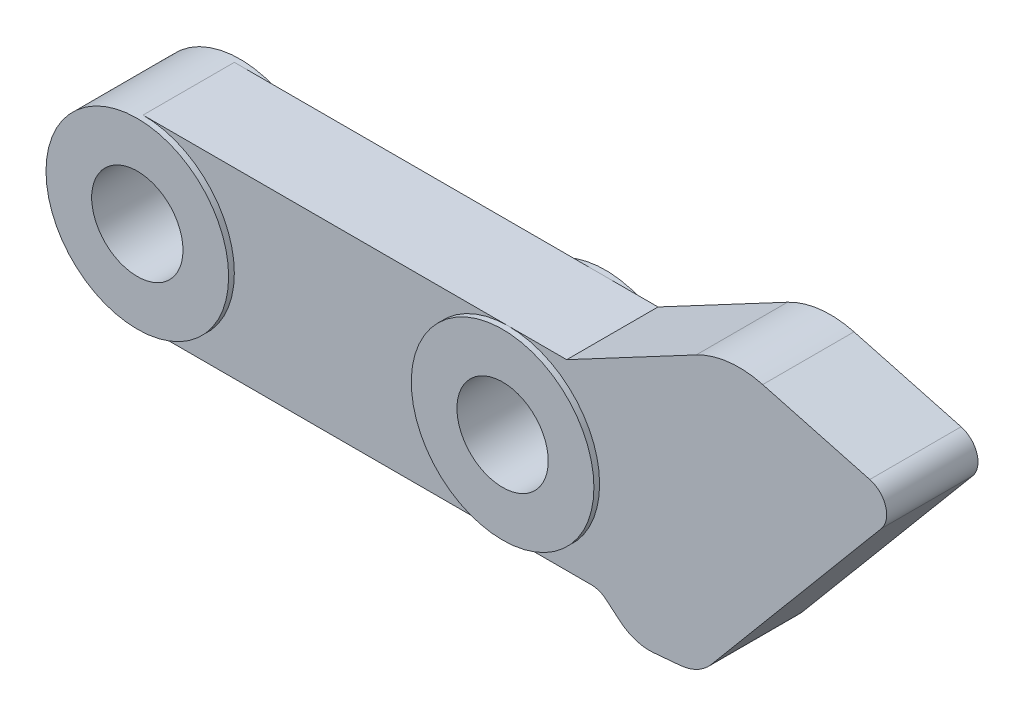
ISO-10303-21;
HEADER;
FILE_DESCRIPTION(('STEP AP214'),'2;1');
FILE_NAME('part.step','',(''),(''),'','','');
FILE_SCHEMA(('AUTOMOTIVE_DESIGN { 1 0 10303 214 1 1 1 1 }'));
ENDSEC;
DATA;
#1=APPLICATION_CONTEXT('core data for automotive mechanical design processes');
#2=APPLICATION_PROTOCOL_DEFINITION('international standard','automotive_design',2000,#1);
#3=PRODUCT_CONTEXT('',#1,'mechanical');
#4=PRODUCT('Part','Part','',(#3));
#5=PRODUCT_RELATED_PRODUCT_CATEGORY('part','',(#4));
#6=PRODUCT_DEFINITION_FORMATION('','',#4);
#7=PRODUCT_DEFINITION_CONTEXT('part definition',#1,'design');
#8=PRODUCT_DEFINITION('design','',#6,#7);
#9=PRODUCT_DEFINITION_SHAPE('','',#8);
#10=(LENGTH_UNIT() NAMED_UNIT(*) SI_UNIT(.MILLI.,.METRE.));
#11=(NAMED_UNIT(*) PLANE_ANGLE_UNIT() SI_UNIT($,.RADIAN.));
#12=(NAMED_UNIT(*) SI_UNIT($,.STERADIAN.) SOLID_ANGLE_UNIT());
#13=UNCERTAINTY_MEASURE_WITH_UNIT(LENGTH_MEASURE(1.E-05),#10,'distance_accuracy_value','');
#14=(GEOMETRIC_REPRESENTATION_CONTEXT(3) GLOBAL_UNCERTAINTY_ASSIGNED_CONTEXT((#13)) GLOBAL_UNIT_ASSIGNED_CONTEXT((#10,
#11,#12)) REPRESENTATION_CONTEXT('',''));
#15=CARTESIAN_POINT('',(0.,0.,0.));
#16=DIRECTION('',(0.,0.,1.));
#17=DIRECTION('',(1.,0.,0.));
#18=AXIS2_PLACEMENT_3D('',#15,#16,#17);
#19=CARTESIAN_POINT('',(0.,0.,0.));
#20=DIRECTION('',(0.,0.,1.));
#21=DIRECTION('',(1.,0.,0.));
#22=AXIS2_PLACEMENT_3D('',#19,#20,#21);
#23=PLANE('',#22);
#24=CARTESIAN_POINT('',(6.35,6.35,0.));
#25=DIRECTION('',(0.,0.,-1.));
#26=DIRECTION('',(-1.,0.,0.));
#27=AXIS2_PLACEMENT_3D('',#24,#25,#26);
#28=CIRCLE('',#27,6.35);
#29=CARTESIAN_POINT('',(6.35,12.7,0.));
#30=VERTEX_POINT('',#29);
#31=CARTESIAN_POINT('',(6.35,0.,0.));
#32=VERTEX_POINT('',#31);
#33=EDGE_CURVE('E153',#30,#32,#28,.T.);
#34=ORIENTED_EDGE('',*,*,#33,.F.);
#35=DIRECTION('',(-1.,0.,0.));
#36=VECTOR('',#35,1.);
#37=CARTESIAN_POINT('',(35.810782513767,12.7,0.));
#38=LINE('',#37,#36);
#39=CARTESIAN_POINT('',(31.75,12.7,0.));
#40=VERTEX_POINT('',#39);
#41=EDGE_CURVE('E162',#40,#30,#38,.T.);
#42=ORIENTED_EDGE('',*,*,#41,.F.);
#43=CARTESIAN_POINT('',(31.75,6.35,0.));
#44=DIRECTION('',(0.,0.,-1.));
#45=DIRECTION('',(-1.,0.,0.));
#46=AXIS2_PLACEMENT_3D('',#43,#44,#45);
#47=CIRCLE('',#46,6.35);
#48=CARTESIAN_POINT('',(31.75,0.,0.));
#49=VERTEX_POINT('',#48);
#50=EDGE_CURVE('E192',#49,#40,#47,.T.);
#51=ORIENTED_EDGE('',*,*,#50,.F.);
#52=DIRECTION('',(1.,0.,0.));
#53=VECTOR('',#52,1.);
#54=CARTESIAN_POINT('',(0.,0.,0.));
#55=LINE('',#54,#53);
#56=EDGE_CURVE('E173',#32,#49,#55,.T.);
#57=ORIENTED_EDGE('',*,*,#56,.F.);
#58=EDGE_LOOP('',(#34,#42,#51,#57));
#59=FACE_BOUND('',#58,.T.);
#60=ADVANCED_FACE('F32',(#59),#23,.F.);
#61=DIRECTION('',(0.996194698091746,0.0871557427476539,0.));
#62=VECTOR('',#61,1.);
#63=CARTESIAN_POINT('',(45.0052328745603,-1.64951021460678,0.));
#64=LINE('',#63,#62);
#65=CARTESIAN_POINT('',(43.695109273344,-1.76413117753096,0.));
#66=VERTEX_POINT('',#65);
#67=CARTESIAN_POINT('',(41.842314708119,-1.92622969783059,0.));
#68=VERTEX_POINT('',#67);
#69=EDGE_CURVE('E270',#66,#68,#64,.F.);
#70=ORIENTED_EDGE('',*,*,#69,.T.);
#71=CARTESIAN_POINT('',(41.5655952248952,1.23668846861071,0.));
#72=DIRECTION('',(0.,0.,1.));
#73=DIRECTION('',(1.,0.,0.));
#74=AXIS2_PLACEMENT_3D('',#71,#72,#73);
#75=CIRCLE('',#74,3.175);
#76=CARTESIAN_POINT('',(39.5247445641404,-1.19550263829205,0.));
#77=VERTEX_POINT('',#76);
#78=EDGE_CURVE('E40',#68,#77,#75,.F.);
#79=ORIENTED_EDGE('',*,*,#78,.T.);
#80=DIRECTION('',(0.766044443118977,-0.64278760968654,0.));
#81=VECTOR('',#80,1.);
#82=CARTESIAN_POINT('',(38.1,0.,0.));
#83=LINE('',#82,#81);
#84=CARTESIAN_POINT('',(38.5426225834798,-0.371404446548626,0.));
#85=VERTEX_POINT('',#84);
#86=EDGE_CURVE('E227',#85,#77,#83,.T.);
#87=ORIENTED_EDGE('',*,*,#86,.F.);
#88=CARTESIAN_POINT('',(37.5221972531024,-1.5875,0.));
#89=DIRECTION('',(0.,0.,1.));
#90=DIRECTION('',(1.,0.,0.));
#91=AXIS2_PLACEMENT_3D('',#88,#89,#90);
#92=CIRCLE('',#91,1.5875);
#93=CARTESIAN_POINT('',(37.5221972531024,0.,0.));
#94=VERTEX_POINT('',#93);
#95=EDGE_CURVE('E266',#85,#94,#92,.T.);
#96=ORIENTED_EDGE('',*,*,#95,.T.);
#97=EDGE_CURVE('E228',#49,#94,#55,.T.);
#98=ORIENTED_EDGE('',*,*,#97,.F.);
#99=EDGE_CURVE('E185',#40,#49,#47,.T.);
#100=ORIENTED_EDGE('',*,*,#99,.F.);
#101=CARTESIAN_POINT('',(35.810782513767,12.7,0.));
#102=VERTEX_POINT('',#101);
#103=EDGE_CURVE('E166',#102,#40,#38,.T.);
#104=ORIENTED_EDGE('',*,*,#103,.F.);
#105=DIRECTION('',(-0.882924960016178,-0.469514126497201,0.));
#106=VECTOR('',#105,1.);
#107=CARTESIAN_POINT('',(47.0239295059724,18.6628294065145,0.));
#108=LINE('',#107,#106);
#109=CARTESIAN_POINT('',(44.8152853652607,17.4883359088446,0.));
#110=VERTEX_POINT('',#109);
#111=EDGE_CURVE('E169',#110,#102,#108,.T.);
#112=ORIENTED_EDGE('',*,*,#111,.F.);
#113=CARTESIAN_POINT('',(47.7967000685179,11.8817624127418,0.));
#114=DIRECTION('',(0.,0.,1.));
#115=DIRECTION('',(1.,0.,0.));
#116=AXIS2_PLACEMENT_3D('',#113,#114,#115);
#117=CIRCLE('',#116,6.35);
#118=CARTESIAN_POINT('',(49.4402010049189,18.0153914096774,0.));
#119=VERTEX_POINT('',#118);
#120=EDGE_CURVE('E240',#110,#119,#117,.F.);
#121=ORIENTED_EDGE('',*,*,#120,.T.);
#122=DIRECTION('',(-0.965925826289069,0.258819045102517,0.));
#123=VECTOR('',#122,1.);
#124=CARTESIAN_POINT('',(59.2911874998436,15.3758275337125,0.));
#125=LINE('',#124,#123);
#126=CARTESIAN_POINT('',(56.8842202568738,16.0207724626744,0.));
#127=VERTEX_POINT('',#126);
#128=EDGE_CURVE('E233',#127,#119,#125,.T.);
#129=ORIENTED_EDGE('',*,*,#128,.F.);
#130=CARTESIAN_POINT('',(56.4733450227735,14.4873652134405,0.));
#131=DIRECTION('',(0.,0.,1.));
#132=DIRECTION('',(1.,0.,0.));
#133=AXIS2_PLACEMENT_3D('',#130,#131,#132);
#134=CIRCLE('',#133,1.5875);
#135=CARTESIAN_POINT('',(57.6894405762249,13.4669398830632,0.));
#136=VERTEX_POINT('',#135);
#137=EDGE_CURVE('E253',#127,#136,#134,.F.);
#138=ORIENTED_EDGE('',*,*,#137,.T.);
#139=DIRECTION('',(0.64278760968654,0.766044443118977,0.));
#140=VECTOR('',#139,1.);
#141=CARTESIAN_POINT('',(42.9643822138055,-4.08170132150953,0.));
#142=LINE('',#141,#140);
#143=CARTESIAN_POINT('',(45.850580897023,-0.642063671844426,0.));
#144=VERTEX_POINT('',#143);
#145=EDGE_CURVE('E231',#144,#136,#142,.T.);
#146=ORIENTED_EDGE('',*,*,#145,.F.);
#147=CARTESIAN_POINT('',(43.4183897901202,1.39878698891034,0.));
#148=DIRECTION('',(0.,0.,1.));
#149=DIRECTION('',(1.,0.,0.));
#150=AXIS2_PLACEMENT_3D('',#147,#148,#149);
#151=CIRCLE('',#150,3.175);
#152=EDGE_CURVE('E47',#144,#66,#151,.F.);
#153=ORIENTED_EDGE('',*,*,#152,.T.);
#154=EDGE_LOOP('',(#70,#79,#87,#96,#98,#100,#104,#112,#121,#129,#138,#146,#153));
#155=FACE_BOUND('',#154,.T.);
#156=ADVANCED_FACE('F288',(#155),#23,.F.);
#157=CARTESIAN_POINT('',(0.,0.,6.35));
#158=DIRECTION('',(0.,0.,1.));
#159=DIRECTION('',(1.,0.,0.));
#160=AXIS2_PLACEMENT_3D('',#157,#158,#159);
#161=PLANE('',#160);
#162=DIRECTION('',(-1.,0.,0.));
#163=VECTOR('',#162,1.);
#164=CARTESIAN_POINT('',(35.810782513767,12.7,6.35));
#165=LINE('',#164,#163);
#166=CARTESIAN_POINT('',(31.75,12.7,6.35));
#167=VERTEX_POINT('',#166);
#168=CARTESIAN_POINT('',(6.35,12.7,6.35));
#169=VERTEX_POINT('',#168);
#170=EDGE_CURVE('E222',#167,#169,#165,.T.);
#171=ORIENTED_EDGE('',*,*,#170,.T.);
#172=CARTESIAN_POINT('',(6.35,6.35,6.35));
#173=DIRECTION('',(0.,0.,1.));
#174=DIRECTION('',(1.,0.,0.));
#175=AXIS2_PLACEMENT_3D('',#172,#173,#174);
#176=CIRCLE('',#175,6.35);
#177=CARTESIAN_POINT('',(6.35,0.,6.35));
#178=VERTEX_POINT('',#177);
#179=EDGE_CURVE('E155',#178,#169,#176,.T.);
#180=ORIENTED_EDGE('',*,*,#179,.F.);
#181=DIRECTION('',(1.,0.,0.));
#182=VECTOR('',#181,1.);
#183=CARTESIAN_POINT('',(0.,0.,6.35));
#184=LINE('',#183,#182);
#185=CARTESIAN_POINT('',(31.75,0.,6.35));
#186=VERTEX_POINT('',#185);
#187=EDGE_CURVE('E209',#178,#186,#184,.T.);
#188=ORIENTED_EDGE('',*,*,#187,.T.);
#189=CARTESIAN_POINT('',(31.75,6.35,6.35));
#190=DIRECTION('',(0.,0.,1.));
#191=DIRECTION('',(1.,0.,0.));
#192=AXIS2_PLACEMENT_3D('',#189,#190,#191);
#193=CIRCLE('',#192,6.35);
#194=EDGE_CURVE('E202',#167,#186,#193,.T.);
#195=ORIENTED_EDGE('',*,*,#194,.F.);
#196=EDGE_LOOP('',(#171,#180,#188,#195));
#197=FACE_BOUND('',#196,.T.);
#198=ADVANCED_FACE('F336',(#197),#161,.T.);
#199=CARTESIAN_POINT('',(0.,0.,6.35));
#200=DIRECTION('',(0.,1.,0.));
#201=DIRECTION('',(0.,0.,1.));
#202=AXIS2_PLACEMENT_3D('',#199,#200,#201);
#203=PLANE('',#202);
#204=ORIENTED_EDGE('',*,*,#97,.T.);
#205=DIRECTION('',(0.,0.,-1.));
#206=VECTOR('',#205,1.);
#207=CARTESIAN_POINT('',(37.5221972531024,0.,6.35));
#208=LINE('',#207,#206);
#209=CARTESIAN_POINT('',(37.5221972531024,0.,6.35));
#210=VERTEX_POINT('',#209);
#211=EDGE_CURVE('E264',#94,#210,#208,.F.);
#212=ORIENTED_EDGE('',*,*,#211,.T.);
#213=EDGE_CURVE('E213',#186,#210,#184,.T.);
#214=ORIENTED_EDGE('',*,*,#213,.F.);
#215=ORIENTED_EDGE('',*,*,#187,.F.);
#216=DIRECTION('',(0.,0.,-1.));
#217=VECTOR('',#216,1.);
#218=CARTESIAN_POINT('',(6.35,0.,6.35));
#219=LINE('',#218,#217);
#220=EDGE_CURVE('E159',#178,#32,#219,.T.);
#221=ORIENTED_EDGE('',*,*,#220,.T.);
#222=ORIENTED_EDGE('',*,*,#56,.T.);
#223=EDGE_LOOP('',(#204,#212,#214,#215,#221,#222));
#224=FACE_BOUND('',#223,.T.);
#225=ADVANCED_FACE('F333',(#224),#203,.F.);
#226=CARTESIAN_POINT('',(38.1,0.,6.35));
#227=DIRECTION('',(0.64278760968654,0.766044443118977,0.));
#228=DIRECTION('',(-0.766044443118977,0.64278760968654,0.));
#229=AXIS2_PLACEMENT_3D('',#226,#227,#228);
#230=PLANE('',#229);
#231=ORIENTED_EDGE('',*,*,#86,.T.);
#232=DIRECTION('',(0.,0.,-1.));
#233=VECTOR('',#232,1.);
#234=CARTESIAN_POINT('',(39.5247445641404,-1.19550263829205,6.35));
#235=LINE('',#234,#233);
#236=CARTESIAN_POINT('',(39.5247445641404,-1.19550263829205,6.35));
#237=VERTEX_POINT('',#236);
#238=EDGE_CURVE('E275',#77,#237,#235,.F.);
#239=ORIENTED_EDGE('',*,*,#238,.T.);
#240=DIRECTION('',(0.766044443118977,-0.64278760968654,0.));
#241=VECTOR('',#240,1.);
#242=CARTESIAN_POINT('',(38.1,0.,6.35));
#243=LINE('',#242,#241);
#244=CARTESIAN_POINT('',(38.5426225834798,-0.371404446548626,6.35));
#245=VERTEX_POINT('',#244);
#246=EDGE_CURVE('E212',#245,#237,#243,.T.);
#247=ORIENTED_EDGE('',*,*,#246,.F.);
#248=DIRECTION('',(0.,0.,-1.));
#249=VECTOR('',#248,1.);
#250=CARTESIAN_POINT('',(38.5426225834798,-0.371404446548626,0.));
#251=LINE('',#250,#249);
#252=EDGE_CURVE('E261',#245,#85,#251,.T.);
#253=ORIENTED_EDGE('',*,*,#252,.T.);
#254=EDGE_LOOP('',(#231,#239,#247,#253));
#255=FACE_BOUND('',#254,.T.);
#256=ADVANCED_FACE('F292',(#255),#230,.F.);
#257=CARTESIAN_POINT('',(42.9643822138055,-4.08170132150953,6.35));
#258=DIRECTION('',(-0.766044443118977,0.64278760968654,0.));
#259=DIRECTION('',(-0.64278760968654,-0.766044443118978,0.));
#260=AXIS2_PLACEMENT_3D('',#257,#258,#259);
#261=PLANE('',#260);
#262=DIRECTION('',(0.64278760968654,0.766044443118977,0.));
#263=VECTOR('',#262,1.);
#264=CARTESIAN_POINT('',(42.9643822138055,-4.08170132150953,6.35));
#265=LINE('',#264,#263);
#266=CARTESIAN_POINT('',(45.850580897023,-0.642063671844426,6.35));
#267=VERTEX_POINT('',#266);
#268=CARTESIAN_POINT('',(57.6894405762249,13.4669398830632,6.35));
#269=VERTEX_POINT('',#268);
#270=EDGE_CURVE('E216',#267,#269,#265,.T.);
#271=ORIENTED_EDGE('',*,*,#270,.F.);
#272=DIRECTION('',(0.,0.,1.));
#273=VECTOR('',#272,1.);
#274=CARTESIAN_POINT('',(45.850580897023,-0.642063671844426,0.));
#275=LINE('',#274,#273);
#276=EDGE_CURVE('E11',#267,#144,#275,.F.);
#277=ORIENTED_EDGE('',*,*,#276,.T.);
#278=ORIENTED_EDGE('',*,*,#145,.T.);
#279=DIRECTION('',(0.,0.,-1.));
#280=VECTOR('',#279,1.);
#281=CARTESIAN_POINT('',(57.6894405762249,13.4669398830632,6.35));
#282=LINE('',#281,#280);
#283=EDGE_CURVE('E256',#136,#269,#282,.F.);
#284=ORIENTED_EDGE('',*,*,#283,.T.);
#285=EDGE_LOOP('',(#271,#277,#278,#284));
#286=FACE_BOUND('',#285,.T.);
#287=ADVANCED_FACE('F302',(#286),#261,.F.);
#288=CARTESIAN_POINT('',(59.2911874998436,15.3758275337125,6.35));
#289=DIRECTION('',(-0.258819045102517,-0.965925826289069,0.));
#290=DIRECTION('',(0.96592582628907,-0.258819045102517,0.));
#291=AXIS2_PLACEMENT_3D('',#288,#289,#290);
#292=PLANE('',#291);
#293=DIRECTION('',(-0.965925826289069,0.258819045102517,0.));
#294=VECTOR('',#293,1.);
#295=CARTESIAN_POINT('',(59.2911874998436,15.3758275337125,6.35));
#296=LINE('',#295,#294);
#297=CARTESIAN_POINT('',(56.8842202568738,16.0207724626744,6.35));
#298=VERTEX_POINT('',#297);
#299=CARTESIAN_POINT('',(49.4402010049189,18.0153914096774,6.35));
#300=VERTEX_POINT('',#299);
#301=EDGE_CURVE('E218',#298,#300,#296,.T.);
#302=ORIENTED_EDGE('',*,*,#301,.F.);
#303=DIRECTION('',(0.,0.,-1.));
#304=VECTOR('',#303,1.);
#305=CARTESIAN_POINT('',(56.8842202568738,16.0207724626744,6.35));
#306=LINE('',#305,#304);
#307=EDGE_CURVE('E250',#298,#127,#306,.T.);
#308=ORIENTED_EDGE('',*,*,#307,.T.);
#309=ORIENTED_EDGE('',*,*,#128,.T.);
#310=DIRECTION('',(0.,0.,-1.));
#311=VECTOR('',#310,1.);
#312=CARTESIAN_POINT('',(49.4402010049189,18.0153914096774,6.35));
#313=LINE('',#312,#311);
#314=EDGE_CURVE('E243',#119,#300,#313,.F.);
#315=ORIENTED_EDGE('',*,*,#314,.T.);
#316=EDGE_LOOP('',(#302,#308,#309,#315));
#317=FACE_BOUND('',#316,.T.);
#318=ADVANCED_FACE('F311',(#317),#292,.F.);
#319=CARTESIAN_POINT('',(47.0239295059724,18.6628294065145,6.35));
#320=DIRECTION('',(0.469514126497201,-0.882924960016178,0.));
#321=DIRECTION('',(0.882924960016178,0.469514126497201,0.));
#322=AXIS2_PLACEMENT_3D('',#319,#320,#321);
#323=PLANE('',#322);
#324=DIRECTION('',(-0.882924960016178,-0.469514126497201,0.));
#325=VECTOR('',#324,1.);
#326=CARTESIAN_POINT('',(47.0239295059724,18.6628294065145,6.35));
#327=LINE('',#326,#325);
#328=CARTESIAN_POINT('',(44.8152853652607,17.4883359088446,6.35));
#329=VERTEX_POINT('',#328);
#330=CARTESIAN_POINT('',(35.810782513767,12.7,6.35));
#331=VERTEX_POINT('',#330);
#332=EDGE_CURVE('E220',#329,#331,#327,.T.);
#333=ORIENTED_EDGE('',*,*,#332,.F.);
#334=DIRECTION('',(0.,0.,-1.));
#335=VECTOR('',#334,1.);
#336=CARTESIAN_POINT('',(44.8152853652607,17.4883359088446,6.35));
#337=LINE('',#336,#335);
#338=EDGE_CURVE('E237',#329,#110,#337,.T.);
#339=ORIENTED_EDGE('',*,*,#338,.T.);
#340=ORIENTED_EDGE('',*,*,#111,.T.);
#341=DIRECTION('',(0.,0.,-1.));
#342=VECTOR('',#341,1.);
#343=CARTESIAN_POINT('',(35.810782513767,12.7,6.35));
#344=LINE('',#343,#342);
#345=EDGE_CURVE('E225',#331,#102,#344,.T.);
#346=ORIENTED_EDGE('',*,*,#345,.F.);
#347=EDGE_LOOP('',(#333,#339,#340,#346));
#348=FACE_BOUND('',#347,.T.);
#349=ADVANCED_FACE('F321',(#348),#323,.F.);
#350=CARTESIAN_POINT('',(35.810782513767,12.7,6.35));
#351=DIRECTION('',(0.,-1.,0.));
#352=DIRECTION('',(1.,0.,0.));
#353=AXIS2_PLACEMENT_3D('',#350,#351,#352);
#354=PLANE('',#353);
#355=ORIENTED_EDGE('',*,*,#103,.T.);
#356=ORIENTED_EDGE('',*,*,#41,.T.);
#357=DIRECTION('',(0.,0.,-1.));
#358=VECTOR('',#357,1.);
#359=CARTESIAN_POINT('',(6.35,12.7,6.35));
#360=LINE('',#359,#358);
#361=EDGE_CURVE('E148',#30,#169,#360,.F.);
#362=ORIENTED_EDGE('',*,*,#361,.T.);
#363=ORIENTED_EDGE('',*,*,#170,.F.);
#364=EDGE_CURVE('E223',#331,#167,#165,.T.);
#365=ORIENTED_EDGE('',*,*,#364,.F.);
#366=ORIENTED_EDGE('',*,*,#345,.T.);
#367=EDGE_LOOP('',(#355,#356,#362,#363,#365,#366));
#368=FACE_BOUND('',#367,.T.);
#369=ADVANCED_FACE('F163',(#368),#354,.F.);
#370=ORIENTED_EDGE('',*,*,#246,.T.);
#371=CARTESIAN_POINT('',(41.5655952248952,1.23668846861071,6.35));
#372=DIRECTION('',(0.,0.,1.));
#373=DIRECTION('',(1.,0.,0.));
#374=AXIS2_PLACEMENT_3D('',#371,#372,#373);
#375=CIRCLE('',#374,3.175);
#376=CARTESIAN_POINT('',(41.842314708119,-1.92622969783058,6.35));
#377=VERTEX_POINT('',#376);
#378=EDGE_CURVE('E280',#237,#377,#375,.T.);
#379=ORIENTED_EDGE('',*,*,#378,.T.);
#380=DIRECTION('',(-0.996194698091746,-0.0871557427476539,0.));
#381=VECTOR('',#380,1.);
#382=CARTESIAN_POINT('',(0.485082528191393,-5.54451866838361,6.35));
#383=LINE('',#382,#381);
#384=CARTESIAN_POINT('',(43.6951092733441,-1.76413117753096,6.35));
#385=VERTEX_POINT('',#384);
#386=EDGE_CURVE('E272',#377,#385,#383,.F.);
#387=ORIENTED_EDGE('',*,*,#386,.T.);
#388=CARTESIAN_POINT('',(43.4183897901202,1.39878698891034,6.35));
#389=DIRECTION('',(0.,0.,1.));
#390=DIRECTION('',(1.,0.,0.));
#391=AXIS2_PLACEMENT_3D('',#388,#389,#390);
#392=CIRCLE('',#391,3.175);
#393=EDGE_CURVE('E278',#385,#267,#392,.T.);
#394=ORIENTED_EDGE('',*,*,#393,.T.);
#395=ORIENTED_EDGE('',*,*,#270,.T.);
#396=CARTESIAN_POINT('',(56.4733450227735,14.4873652134405,6.35));
#397=DIRECTION('',(0.,0.,1.));
#398=DIRECTION('',(1.,0.,0.));
#399=AXIS2_PLACEMENT_3D('',#396,#397,#398);
#400=CIRCLE('',#399,1.5875);
#401=EDGE_CURVE('E259',#269,#298,#400,.T.);
#402=ORIENTED_EDGE('',*,*,#401,.T.);
#403=ORIENTED_EDGE('',*,*,#301,.T.);
#404=CARTESIAN_POINT('',(47.7967000685179,11.8817624127418,6.35));
#405=DIRECTION('',(0.,0.,1.));
#406=DIRECTION('',(1.,0.,0.));
#407=AXIS2_PLACEMENT_3D('',#404,#405,#406);
#408=CIRCLE('',#407,6.35);
#409=EDGE_CURVE('E246',#300,#329,#408,.T.);
#410=ORIENTED_EDGE('',*,*,#409,.T.);
#411=ORIENTED_EDGE('',*,*,#332,.T.);
#412=ORIENTED_EDGE('',*,*,#364,.T.);
#413=EDGE_CURVE('E158',#186,#167,#193,.T.);
#414=ORIENTED_EDGE('',*,*,#413,.F.);
#415=ORIENTED_EDGE('',*,*,#213,.T.);
#416=CARTESIAN_POINT('',(37.5221972531024,-1.5875,6.35));
#417=DIRECTION('',(0.,0.,1.));
#418=DIRECTION('',(1.,0.,0.));
#419=AXIS2_PLACEMENT_3D('',#416,#417,#418);
#420=CIRCLE('',#419,1.5875);
#421=EDGE_CURVE('E268',#210,#245,#420,.F.);
#422=ORIENTED_EDGE('',*,*,#421,.T.);
#423=EDGE_LOOP('',(#370,#379,#387,#394,#395,#402,#403,#410,#411,#412,#414,#415,#422));
#424=FACE_BOUND('',#423,.T.);
#425=ADVANCED_FACE('F297',(#424),#161,.T.);
#426=CARTESIAN_POINT('',(47.7967000685179,11.8817624127418,6.35));
#427=DIRECTION('',(0.,0.,-1.));
#428=DIRECTION('',(-1.,0.,0.));
#429=AXIS2_PLACEMENT_3D('',#426,#427,#428);
#430=CYLINDRICAL_SURFACE('',#429,6.35);
#431=ORIENTED_EDGE('',*,*,#409,.F.);
#432=ORIENTED_EDGE('',*,*,#314,.F.);
#433=ORIENTED_EDGE('',*,*,#120,.F.);
#434=ORIENTED_EDGE('',*,*,#338,.F.);
#435=EDGE_LOOP('',(#431,#432,#433,#434));
#436=FACE_BOUND('',#435,.T.);
#437=ADVANCED_FACE('F317',(#436),#430,.T.);
#438=CARTESIAN_POINT('',(6.35,6.35,6.35));
#439=DIRECTION('',(0.,0.,-1.));
#440=DIRECTION('',(-1.,0.,0.));
#441=AXIS2_PLACEMENT_3D('',#438,#439,#440);
#442=CYLINDRICAL_SURFACE('',#441,6.35);
#443=DIRECTION('',(0.,0.,-1.));
#444=VECTOR('',#443,1.);
#445=CARTESIAN_POINT('',(0.,6.35,6.35));
#446=LINE('',#445,#444);
#447=CARTESIAN_POINT('',(0.,6.35,6.35));
#448=VERTEX_POINT('',#447);
#449=CARTESIAN_POINT('',(0.,6.35,0.));
#450=VERTEX_POINT('',#449);
#451=EDGE_CURVE('E206',#448,#450,#446,.T.);
#452=ORIENTED_EDGE('',*,*,#451,.T.);
#453=ORIENTED_EDGE('',*,*,#451,.F.);
#454=EDGE_LOOP('',(#452,#453));
#455=FACE_BOUND('',#454,.T.);
#456=ORIENTED_EDGE('',*,*,#33,.T.);
#457=ORIENTED_EDGE('',*,*,#220,.F.);
#458=ORIENTED_EDGE('',*,*,#179,.T.);
#459=ORIENTED_EDGE('',*,*,#361,.F.);
#460=EDGE_LOOP('',(#456,#457,#458,#459));
#461=FACE_BOUND('',#460,.T.);
#462=CARTESIAN_POINT('',(6.35,6.35,6.746875));
#463=DIRECTION('',(0.,0.,1.));
#464=DIRECTION('',(1.,0.,0.));
#465=AXIS2_PLACEMENT_3D('',#462,#463,#464);
#466=CIRCLE('',#465,6.35);
#467=CARTESIAN_POINT('',(12.7,6.35,6.746875));
#468=VERTEX_POINT('',#467);
#469=EDGE_CURVE('E195',#468,#468,#466,.T.);
#470=ORIENTED_EDGE('',*,*,#469,.F.);
#471=EDGE_LOOP('',(#470));
#472=FACE_BOUND('',#471,.T.);
#473=CARTESIAN_POINT('',(6.35,6.35,-0.396875));
#474=DIRECTION('',(0.,0.,-1.));
#475=DIRECTION('',(-1.,0.,0.));
#476=AXIS2_PLACEMENT_3D('',#473,#474,#475);
#477=CIRCLE('',#476,6.35);
#478=CARTESIAN_POINT('',(0.,6.35,-0.396875));
#479=VERTEX_POINT('',#478);
#480=EDGE_CURVE('E174',#479,#479,#477,.T.);
#481=ORIENTED_EDGE('',*,*,#480,.F.);
#482=EDGE_LOOP('',(#481));
#483=FACE_BOUND('',#482,.T.);
#484=ADVANCED_FACE('F150',(#455,#461,#472,#483),#442,.T.);
#485=CARTESIAN_POINT('',(31.75,6.35,-8.98025612106915));
#486=DIRECTION('',(0.,0.,1.));
#487=DIRECTION('',(1.,0.,0.));
#488=AXIS2_PLACEMENT_3D('',#485,#486,#487);
#489=CYLINDRICAL_SURFACE('',#488,3.175);
#490=CARTESIAN_POINT('',(31.75,6.35,6.746875));
#491=DIRECTION('',(0.,0.,1.));
#492=DIRECTION('',(1.,0.,0.));
#493=AXIS2_PLACEMENT_3D('',#490,#491,#492);
#494=CIRCLE('',#493,3.175);
#495=CARTESIAN_POINT('',(34.925,6.35,6.746875));
#496=VERTEX_POINT('',#495);
#497=EDGE_CURVE('E198',#496,#496,#494,.T.);
#498=ORIENTED_EDGE('',*,*,#497,.T.);
#499=EDGE_LOOP('',(#498));
#500=FACE_BOUND('',#499,.T.);
#501=CARTESIAN_POINT('',(31.75,6.35,-0.396875));
#502=DIRECTION('',(0.,0.,-1.));
#503=DIRECTION('',(-1.,0.,0.));
#504=AXIS2_PLACEMENT_3D('',#501,#502,#503);
#505=CIRCLE('',#504,3.175);
#506=CARTESIAN_POINT('',(28.575,6.35,-0.396875));
#507=VERTEX_POINT('',#506);
#508=EDGE_CURVE('E178',#507,#507,#505,.T.);
#509=ORIENTED_EDGE('',*,*,#508,.T.);
#510=EDGE_LOOP('',(#509));
#511=FACE_BOUND('',#510,.T.);
#512=ADVANCED_FACE('F379',(#500,#511),#489,.F.);
#513=CARTESIAN_POINT('',(6.35,6.35,-8.98025612106915));
#514=DIRECTION('',(0.,0.,1.));
#515=DIRECTION('',(1.,0.,0.));
#516=AXIS2_PLACEMENT_3D('',#513,#514,#515);
#517=CYLINDRICAL_SURFACE('',#516,3.175);
#518=CARTESIAN_POINT('',(6.35,6.35,6.746875));
#519=DIRECTION('',(0.,0.,1.));
#520=DIRECTION('',(1.,0.,0.));
#521=AXIS2_PLACEMENT_3D('',#518,#519,#520);
#522=CIRCLE('',#521,3.175);
#523=CARTESIAN_POINT('',(9.525,6.35,6.746875));
#524=VERTEX_POINT('',#523);
#525=EDGE_CURVE('E189',#524,#524,#522,.T.);
#526=ORIENTED_EDGE('',*,*,#525,.T.);
#527=EDGE_LOOP('',(#526));
#528=FACE_BOUND('',#527,.T.);
#529=CARTESIAN_POINT('',(6.35,6.35,-0.396875));
#530=DIRECTION('',(0.,0.,-1.));
#531=DIRECTION('',(-1.,0.,0.));
#532=AXIS2_PLACEMENT_3D('',#529,#530,#531);
#533=CIRCLE('',#532,3.175);
#534=CARTESIAN_POINT('',(3.175,6.35,-0.396875));
#535=VERTEX_POINT('',#534);
#536=EDGE_CURVE('E175',#535,#535,#533,.T.);
#537=ORIENTED_EDGE('',*,*,#536,.T.);
#538=EDGE_LOOP('',(#537));
#539=FACE_BOUND('',#538,.T.);
#540=ADVANCED_FACE('F350',(#528,#539),#517,.F.);
#541=CARTESIAN_POINT('',(31.75,6.35,6.746875));
#542=DIRECTION('',(0.,0.,1.));
#543=DIRECTION('',(1.,0.,0.));
#544=AXIS2_PLACEMENT_3D('',#541,#542,#543);
#545=PLANE('',#544);
#546=CARTESIAN_POINT('',(31.75,6.35,6.746875));
#547=DIRECTION('',(0.,0.,1.));
#548=DIRECTION('',(1.,0.,0.));
#549=AXIS2_PLACEMENT_3D('',#546,#547,#548);
#550=CIRCLE('',#549,6.35);
#551=CARTESIAN_POINT('',(38.1,6.35,6.746875));
#552=VERTEX_POINT('',#551);
#553=EDGE_CURVE('E203',#552,#552,#550,.T.);
#554=ORIENTED_EDGE('',*,*,#553,.T.);
#555=EDGE_LOOP('',(#554));
#556=FACE_BOUND('',#555,.T.);
#557=ORIENTED_EDGE('',*,*,#497,.F.);
#558=EDGE_LOOP('',(#557));
#559=FACE_BOUND('',#558,.T.);
#560=ADVANCED_FACE('F340',(#556,#559),#545,.T.);
#561=CARTESIAN_POINT('',(31.75,6.35,6.746875));
#562=DIRECTION('',(0.,0.,-1.));
#563=DIRECTION('',(-1.,0.,0.));
#564=AXIS2_PLACEMENT_3D('',#561,#562,#563);
#565=CYLINDRICAL_SURFACE('',#564,6.35);
#566=ORIENTED_EDGE('',*,*,#553,.F.);
#567=EDGE_LOOP('',(#566));
#568=FACE_BOUND('',#567,.T.);
#569=ORIENTED_EDGE('',*,*,#194,.T.);
#570=ORIENTED_EDGE('',*,*,#413,.T.);
#571=EDGE_LOOP('',(#569,#570));
#572=FACE_BOUND('',#571,.T.);
#573=ADVANCED_FACE('F337',(#568,#572),#565,.T.);
#574=CARTESIAN_POINT('',(6.35,6.35,6.746875));
#575=DIRECTION('',(0.,0.,1.));
#576=DIRECTION('',(1.,0.,0.));
#577=AXIS2_PLACEMENT_3D('',#574,#575,#576);
#578=PLANE('',#577);
#579=ORIENTED_EDGE('',*,*,#469,.T.);
#580=EDGE_LOOP('',(#579));
#581=FACE_BOUND('',#580,.T.);
#582=ORIENTED_EDGE('',*,*,#525,.F.);
#583=EDGE_LOOP('',(#582));
#584=FACE_BOUND('',#583,.T.);
#585=ADVANCED_FACE('F339',(#581,#584),#578,.T.);
#586=CARTESIAN_POINT('',(31.75,6.35,-0.396875));
#587=DIRECTION('',(0.,0.,-1.));
#588=DIRECTION('',(-1.,0.,0.));
#589=AXIS2_PLACEMENT_3D('',#586,#587,#588);
#590=PLANE('',#589);
#591=CARTESIAN_POINT('',(31.75,6.35,-0.396875));
#592=DIRECTION('',(0.,0.,-1.));
#593=DIRECTION('',(-1.,0.,0.));
#594=AXIS2_PLACEMENT_3D('',#591,#592,#593);
#595=CIRCLE('',#594,6.35);
#596=CARTESIAN_POINT('',(25.4,6.35,-0.396875));
#597=VERTEX_POINT('',#596);
#598=EDGE_CURVE('E186',#597,#597,#595,.T.);
#599=ORIENTED_EDGE('',*,*,#598,.T.);
#600=EDGE_LOOP('',(#599));
#601=FACE_BOUND('',#600,.T.);
#602=ORIENTED_EDGE('',*,*,#508,.F.);
#603=EDGE_LOOP('',(#602));
#604=FACE_BOUND('',#603,.T.);
#605=ADVANCED_FACE('F347',(#601,#604),#590,.T.);
#606=CARTESIAN_POINT('',(31.75,6.35,-0.396875));
#607=DIRECTION('',(0.,0.,1.));
#608=DIRECTION('',(1.,0.,0.));
#609=AXIS2_PLACEMENT_3D('',#606,#607,#608);
#610=CYLINDRICAL_SURFACE('',#609,6.35);
#611=ORIENTED_EDGE('',*,*,#598,.F.);
#612=EDGE_LOOP('',(#611));
#613=FACE_BOUND('',#612,.T.);
#614=ORIENTED_EDGE('',*,*,#99,.T.);
#615=ORIENTED_EDGE('',*,*,#50,.T.);
#616=EDGE_LOOP('',(#614,#615));
#617=FACE_BOUND('',#616,.T.);
#618=ADVANCED_FACE('F469',(#613,#617),#610,.T.);
#619=CARTESIAN_POINT('',(6.35,6.35,-0.396875));
#620=DIRECTION('',(0.,0.,-1.));
#621=DIRECTION('',(-1.,0.,0.));
#622=AXIS2_PLACEMENT_3D('',#619,#620,#621);
#623=PLANE('',#622);
#624=ORIENTED_EDGE('',*,*,#480,.T.);
#625=EDGE_LOOP('',(#624));
#626=FACE_BOUND('',#625,.T.);
#627=ORIENTED_EDGE('',*,*,#536,.F.);
#628=EDGE_LOOP('',(#627));
#629=FACE_BOUND('',#628,.T.);
#630=ADVANCED_FACE('F384',(#626,#629),#623,.T.);
#631=CARTESIAN_POINT('',(56.4733450227735,14.4873652134405,6.35));
#632=DIRECTION('',(0.,0.,-1.));
#633=DIRECTION('',(-1.,0.,0.));
#634=AXIS2_PLACEMENT_3D('',#631,#632,#633);
#635=CYLINDRICAL_SURFACE('',#634,1.5875);
#636=ORIENTED_EDGE('',*,*,#401,.F.);
#637=ORIENTED_EDGE('',*,*,#283,.F.);
#638=ORIENTED_EDGE('',*,*,#137,.F.);
#639=ORIENTED_EDGE('',*,*,#307,.F.);
#640=EDGE_LOOP('',(#636,#637,#638,#639));
#641=FACE_BOUND('',#640,.T.);
#642=ADVANCED_FACE('F308',(#641),#635,.T.);
#643=CARTESIAN_POINT('',(37.5221972531024,-1.5875,6.35));
#644=DIRECTION('',(0.,0.,1.));
#645=DIRECTION('',(1.,0.,0.));
#646=AXIS2_PLACEMENT_3D('',#643,#644,#645);
#647=CYLINDRICAL_SURFACE('',#646,1.5875);
#648=ORIENTED_EDGE('',*,*,#421,.F.);
#649=ORIENTED_EDGE('',*,*,#211,.F.);
#650=ORIENTED_EDGE('',*,*,#95,.F.);
#651=ORIENTED_EDGE('',*,*,#252,.F.);
#652=EDGE_LOOP('',(#648,#649,#650,#651));
#653=FACE_BOUND('',#652,.T.);
#654=ADVANCED_FACE('F383',(#653),#647,.F.);
#655=CARTESIAN_POINT('',(45.0052328745603,-1.64951021460678,6.35));
#656=DIRECTION('',(-0.0871557427476539,0.996194698091746,0.));
#657=DIRECTION('',(0.,0.,-1.));
#658=AXIS2_PLACEMENT_3D('',#655,#656,#657);
#659=PLANE('',#658);
#660=ORIENTED_EDGE('',*,*,#386,.F.);
#661=DIRECTION('',(0.,0.,1.));
#662=VECTOR('',#661,1.);
#663=CARTESIAN_POINT('',(41.842314708119,-1.92622969783059,0.));
#664=LINE('',#663,#662);
#665=EDGE_CURVE('E54',#377,#68,#664,.F.);
#666=ORIENTED_EDGE('',*,*,#665,.T.);
#667=ORIENTED_EDGE('',*,*,#69,.F.);
#668=DIRECTION('',(0.,0.,-1.));
#669=VECTOR('',#668,1.);
#670=CARTESIAN_POINT('',(43.695109273344,-1.76413117753096,6.35));
#671=LINE('',#670,#669);
#672=EDGE_CURVE('E282',#66,#385,#671,.F.);
#673=ORIENTED_EDGE('',*,*,#672,.T.);
#674=EDGE_LOOP('',(#660,#666,#667,#673));
#675=FACE_BOUND('',#674,.T.);
#676=ADVANCED_FACE('F299',(#675),#659,.F.);
#677=CARTESIAN_POINT('',(41.5655952248952,1.23668846861071,6.35));
#678=DIRECTION('',(0.,0.,1.));
#679=DIRECTION('',(1.,0.,0.));
#680=AXIS2_PLACEMENT_3D('',#677,#678,#679);
#681=CYLINDRICAL_SURFACE('',#680,3.175);
#682=ORIENTED_EDGE('',*,*,#78,.F.);
#683=ORIENTED_EDGE('',*,*,#665,.F.);
#684=ORIENTED_EDGE('',*,*,#378,.F.);
#685=ORIENTED_EDGE('',*,*,#238,.F.);
#686=EDGE_LOOP('',(#682,#683,#684,#685));
#687=FACE_BOUND('',#686,.T.);
#688=ADVANCED_FACE('F295',(#687),#681,.T.);
#689=CARTESIAN_POINT('',(43.4183897901202,1.39878698891034,6.35));
#690=DIRECTION('',(0.,0.,-1.));
#691=DIRECTION('',(-1.,0.,0.));
#692=AXIS2_PLACEMENT_3D('',#689,#690,#691);
#693=CYLINDRICAL_SURFACE('',#692,3.175);
#694=ORIENTED_EDGE('',*,*,#393,.F.);
#695=ORIENTED_EDGE('',*,*,#672,.F.);
#696=ORIENTED_EDGE('',*,*,#152,.F.);
#697=ORIENTED_EDGE('',*,*,#276,.F.);
#698=EDGE_LOOP('',(#694,#695,#696,#697));
#699=FACE_BOUND('',#698,.T.);
#700=ADVANCED_FACE('F34',(#699),#693,.T.);
#701=CLOSED_SHELL('',(#60,#156,#198,#225,#256,#287,#318,#349,#369,#425,#437,#484,#512,#540,#560,
#573,#585,#605,#618,#630,#642,#654,#676,#688,#700));
#702=MANIFOLD_SOLID_BREP('B2',#701);
#703=ADVANCED_BREP_SHAPE_REPRESENTATION('',(#18,#702),#14);
#704=SHAPE_DEFINITION_REPRESENTATION(#9,#703);
ENDSEC;
END-ISO-10303-21;
